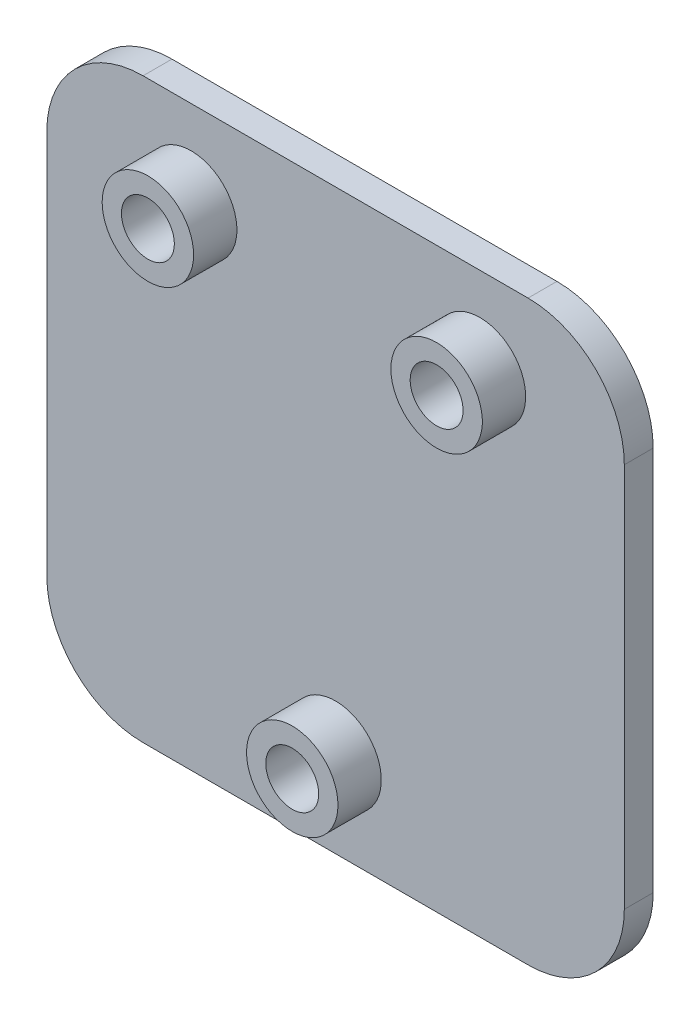
ISO-10303-21;
HEADER;
FILE_DESCRIPTION(('STEP AP214'),'2;1');
FILE_NAME('part.step','',(''),(''),'','','');
FILE_SCHEMA(('AUTOMOTIVE_DESIGN { 1 0 10303 214 1 1 1 1 }'));
ENDSEC;
DATA;
#1=APPLICATION_CONTEXT('core data for automotive mechanical design processes');
#2=APPLICATION_PROTOCOL_DEFINITION('international standard','automotive_design',2000,#1);
#3=PRODUCT_CONTEXT('',#1,'mechanical');
#4=PRODUCT('Part','Part','',(#3));
#5=PRODUCT_RELATED_PRODUCT_CATEGORY('part','',(#4));
#6=PRODUCT_DEFINITION_FORMATION('','',#4);
#7=PRODUCT_DEFINITION_CONTEXT('part definition',#1,'design');
#8=PRODUCT_DEFINITION('design','',#6,#7);
#9=PRODUCT_DEFINITION_SHAPE('','',#8);
#10=(LENGTH_UNIT() NAMED_UNIT(*) SI_UNIT(.MILLI.,.METRE.));
#11=(NAMED_UNIT(*) PLANE_ANGLE_UNIT() SI_UNIT($,.RADIAN.));
#12=(NAMED_UNIT(*) SI_UNIT($,.STERADIAN.) SOLID_ANGLE_UNIT());
#13=UNCERTAINTY_MEASURE_WITH_UNIT(LENGTH_MEASURE(1.E-05),#10,'distance_accuracy_value','');
#14=(GEOMETRIC_REPRESENTATION_CONTEXT(3) GLOBAL_UNCERTAINTY_ASSIGNED_CONTEXT((#13)) GLOBAL_UNIT_ASSIGNED_CONTEXT((#10,
#11,#12)) REPRESENTATION_CONTEXT('',''));
#15=CARTESIAN_POINT('',(0.,0.,0.));
#16=DIRECTION('',(0.,0.,1.));
#17=DIRECTION('',(1.,0.,0.));
#18=AXIS2_PLACEMENT_3D('',#15,#16,#17);
#19=CARTESIAN_POINT('',(-20.,20.,3.));
#20=DIRECTION('',(0.,0.,-1.));
#21=DIRECTION('',(-1.,0.,0.));
#22=AXIS2_PLACEMENT_3D('',#19,#20,#21);
#23=PLANE('',#22);
#24=CARTESIAN_POINT('',(0.,-21.,3.));
#25=DIRECTION('',(0.,0.,-1.));
#26=DIRECTION('',(-1.,0.,0.));
#27=AXIS2_PLACEMENT_3D('',#24,#25,#26);
#28=CIRCLE('',#27,4.74999999999999);
#29=CARTESIAN_POINT('',(-4.74999999999999,-21.,3.));
#30=VERTEX_POINT('',#29);
#31=EDGE_CURVE('E46',#30,#30,#28,.F.);
#32=ORIENTED_EDGE('',*,*,#31,.F.);
#33=EDGE_LOOP('',(#32));
#34=FACE_BOUND('',#33,.T.);
#35=CARTESIAN_POINT('',(-20.,20.,3.));
#36=DIRECTION('',(0.,0.,1.));
#37=DIRECTION('',(-1.,0.,0.));
#38=AXIS2_PLACEMENT_3D('',#35,#36,#37);
#39=CIRCLE('',#38,10.);
#40=CARTESIAN_POINT('',(-19.9999999999999,30.,3.));
#41=VERTEX_POINT('',#40);
#42=CARTESIAN_POINT('',(-30.,19.9999999999999,3.));
#43=VERTEX_POINT('',#42);
#44=EDGE_CURVE('E150',#41,#43,#39,.T.);
#45=ORIENTED_EDGE('',*,*,#44,.T.);
#46=DIRECTION('',(0.,-1.,0.));
#47=VECTOR('',#46,1.);
#48=CARTESIAN_POINT('',(-30.,-19.9999999999999,3.));
#49=LINE('',#48,#47);
#50=CARTESIAN_POINT('',(-30.,-19.9999999999999,3.));
#51=VERTEX_POINT('',#50);
#52=EDGE_CURVE('E98',#43,#51,#49,.T.);
#53=ORIENTED_EDGE('',*,*,#52,.T.);
#54=CARTESIAN_POINT('',(-20.,-20.,3.));
#55=DIRECTION('',(0.,0.,1.));
#56=DIRECTION('',(-1.,0.,0.));
#57=AXIS2_PLACEMENT_3D('',#54,#55,#56);
#58=CIRCLE('',#57,10.);
#59=CARTESIAN_POINT('',(-19.9999999999999,-30.,3.));
#60=VERTEX_POINT('',#59);
#61=EDGE_CURVE('E214',#51,#60,#58,.T.);
#62=ORIENTED_EDGE('',*,*,#61,.T.);
#63=DIRECTION('',(1.,0.,0.));
#64=VECTOR('',#63,1.);
#65=CARTESIAN_POINT('',(-19.9999999999999,-30.,3.));
#66=LINE('',#65,#64);
#67=CARTESIAN_POINT('',(19.9999999999999,-30.,3.));
#68=VERTEX_POINT('',#67);
#69=EDGE_CURVE('E220',#60,#68,#66,.T.);
#70=ORIENTED_EDGE('',*,*,#69,.T.);
#71=CARTESIAN_POINT('',(20.,-20.,3.));
#72=DIRECTION('',(0.,0.,1.));
#73=DIRECTION('',(1.,0.,0.));
#74=AXIS2_PLACEMENT_3D('',#71,#72,#73);
#75=CIRCLE('',#74,10.);
#76=CARTESIAN_POINT('',(30.,-20.,3.));
#77=VERTEX_POINT('',#76);
#78=EDGE_CURVE('E117',#68,#77,#75,.T.);
#79=ORIENTED_EDGE('',*,*,#78,.T.);
#80=DIRECTION('',(0.,1.,0.));
#81=VECTOR('',#80,1.);
#82=CARTESIAN_POINT('',(30.,-19.9999999999999,3.));
#83=LINE('',#82,#81);
#84=CARTESIAN_POINT('',(30.,19.9999999999999,3.));
#85=VERTEX_POINT('',#84);
#86=EDGE_CURVE('E111',#77,#85,#83,.T.);
#87=ORIENTED_EDGE('',*,*,#86,.T.);
#88=CARTESIAN_POINT('',(20.,20.,3.));
#89=DIRECTION('',(0.,0.,1.));
#90=DIRECTION('',(-1.,0.,0.));
#91=AXIS2_PLACEMENT_3D('',#88,#89,#90);
#92=CIRCLE('',#91,10.);
#93=CARTESIAN_POINT('',(19.9999999999999,30.,3.));
#94=VERTEX_POINT('',#93);
#95=EDGE_CURVE('E115',#85,#94,#92,.T.);
#96=ORIENTED_EDGE('',*,*,#95,.T.);
#97=DIRECTION('',(-1.,0.,0.));
#98=VECTOR('',#97,1.);
#99=CARTESIAN_POINT('',(-19.9999999999999,30.,3.));
#100=LINE('',#99,#98);
#101=EDGE_CURVE('E54',#94,#41,#100,.T.);
#102=ORIENTED_EDGE('',*,*,#101,.T.);
#103=EDGE_LOOP('',(#45,#53,#62,#70,#79,#87,#96,#102));
#104=FACE_BOUND('',#103,.T.);
#105=CARTESIAN_POINT('',(-15.,21.,3.));
#106=DIRECTION('',(0.,0.,-1.));
#107=DIRECTION('',(-1.,0.,0.));
#108=AXIS2_PLACEMENT_3D('',#105,#106,#107);
#109=CIRCLE('',#108,4.74999999999999);
#110=CARTESIAN_POINT('',(-19.75,21.,3.));
#111=VERTEX_POINT('',#110);
#112=EDGE_CURVE('E165',#111,#111,#109,.F.);
#113=ORIENTED_EDGE('',*,*,#112,.F.);
#114=EDGE_LOOP('',(#113));
#115=FACE_BOUND('',#114,.T.);
#116=CARTESIAN_POINT('',(15.,21.,3.));
#117=DIRECTION('',(0.,0.,-1.));
#118=DIRECTION('',(-1.,0.,0.));
#119=AXIS2_PLACEMENT_3D('',#116,#117,#118);
#120=CIRCLE('',#119,4.74999999999999);
#121=CARTESIAN_POINT('',(10.25,21.,3.));
#122=VERTEX_POINT('',#121);
#123=EDGE_CURVE('E11',#122,#122,#120,.F.);
#124=ORIENTED_EDGE('',*,*,#123,.F.);
#125=EDGE_LOOP('',(#124));
#126=FACE_BOUND('',#125,.T.);
#127=ADVANCED_FACE('F37',(#34,#104,#115,#126),#23,.F.);
#128=CARTESIAN_POINT('',(-20.,20.,0.));
#129=DIRECTION('',(0.,0.,-1.));
#130=DIRECTION('',(-1.,0.,0.));
#131=AXIS2_PLACEMENT_3D('',#128,#129,#130);
#132=PLANE('',#131);
#133=CARTESIAN_POINT('',(0.,-21.,0.));
#134=DIRECTION('',(0.,0.,1.));
#135=DIRECTION('',(1.,0.,0.));
#136=AXIS2_PLACEMENT_3D('',#133,#134,#135);
#137=CIRCLE('',#136,2.75);
#138=CARTESIAN_POINT('',(2.75,-21.,0.));
#139=VERTEX_POINT('',#138);
#140=EDGE_CURVE('E228',#139,#139,#137,.T.);
#141=ORIENTED_EDGE('',*,*,#140,.T.);
#142=EDGE_LOOP('',(#141));
#143=FACE_BOUND('',#142,.T.);
#144=CARTESIAN_POINT('',(-20.,20.,0.));
#145=DIRECTION('',(0.,0.,1.));
#146=DIRECTION('',(-1.,0.,0.));
#147=AXIS2_PLACEMENT_3D('',#144,#145,#146);
#148=CIRCLE('',#147,10.);
#149=CARTESIAN_POINT('',(-19.9999999999999,30.,0.));
#150=VERTEX_POINT('',#149);
#151=CARTESIAN_POINT('',(-30.,19.9999999999999,0.));
#152=VERTEX_POINT('',#151);
#153=EDGE_CURVE('E135',#150,#152,#148,.T.);
#154=ORIENTED_EDGE('',*,*,#153,.F.);
#155=DIRECTION('',(-1.,0.,0.));
#156=VECTOR('',#155,1.);
#157=CARTESIAN_POINT('',(-19.9999999999999,30.,0.));
#158=LINE('',#157,#156);
#159=CARTESIAN_POINT('',(19.9999999999999,30.,0.));
#160=VERTEX_POINT('',#159);
#161=EDGE_CURVE('E89',#160,#150,#158,.T.);
#162=ORIENTED_EDGE('',*,*,#161,.F.);
#163=CARTESIAN_POINT('',(20.,20.,0.));
#164=DIRECTION('',(0.,0.,1.));
#165=DIRECTION('',(-1.,0.,0.));
#166=AXIS2_PLACEMENT_3D('',#163,#164,#165);
#167=CIRCLE('',#166,10.);
#168=CARTESIAN_POINT('',(30.,19.9999999999999,0.));
#169=VERTEX_POINT('',#168);
#170=EDGE_CURVE('E83',#169,#160,#167,.T.);
#171=ORIENTED_EDGE('',*,*,#170,.F.);
#172=DIRECTION('',(0.,1.,0.));
#173=VECTOR('',#172,1.);
#174=CARTESIAN_POINT('',(30.,-19.9999999999999,0.));
#175=LINE('',#174,#173);
#176=CARTESIAN_POINT('',(30.,-20.,0.));
#177=VERTEX_POINT('',#176);
#178=EDGE_CURVE('E125',#177,#169,#175,.T.);
#179=ORIENTED_EDGE('',*,*,#178,.F.);
#180=CARTESIAN_POINT('',(20.,-20.,0.));
#181=DIRECTION('',(0.,0.,1.));
#182=DIRECTION('',(1.,0.,0.));
#183=AXIS2_PLACEMENT_3D('',#180,#181,#182);
#184=CIRCLE('',#183,10.);
#185=CARTESIAN_POINT('',(19.9999999999999,-30.,0.));
#186=VERTEX_POINT('',#185);
#187=EDGE_CURVE('E145',#186,#177,#184,.T.);
#188=ORIENTED_EDGE('',*,*,#187,.F.);
#189=DIRECTION('',(1.,0.,0.));
#190=VECTOR('',#189,1.);
#191=CARTESIAN_POINT('',(-19.9999999999999,-30.,0.));
#192=LINE('',#191,#190);
#193=CARTESIAN_POINT('',(-19.9999999999999,-30.,0.));
#194=VERTEX_POINT('',#193);
#195=EDGE_CURVE('E143',#194,#186,#192,.T.);
#196=ORIENTED_EDGE('',*,*,#195,.F.);
#197=CARTESIAN_POINT('',(-20.,-20.,0.));
#198=DIRECTION('',(0.,0.,1.));
#199=DIRECTION('',(-1.,0.,0.));
#200=AXIS2_PLACEMENT_3D('',#197,#198,#199);
#201=CIRCLE('',#200,10.);
#202=CARTESIAN_POINT('',(-30.,-19.9999999999999,0.));
#203=VERTEX_POINT('',#202);
#204=EDGE_CURVE('E141',#203,#194,#201,.T.);
#205=ORIENTED_EDGE('',*,*,#204,.F.);
#206=DIRECTION('',(0.,-1.,0.));
#207=VECTOR('',#206,1.);
#208=CARTESIAN_POINT('',(-30.,-19.9999999999999,0.));
#209=LINE('',#208,#207);
#210=EDGE_CURVE('E138',#152,#203,#209,.T.);
#211=ORIENTED_EDGE('',*,*,#210,.F.);
#212=EDGE_LOOP('',(#154,#162,#171,#179,#188,#196,#205,#211));
#213=FACE_BOUND('',#212,.T.);
#214=CARTESIAN_POINT('',(-15.,21.,0.));
#215=DIRECTION('',(0.,0.,1.));
#216=DIRECTION('',(1.,0.,0.));
#217=AXIS2_PLACEMENT_3D('',#214,#215,#216);
#218=CIRCLE('',#217,2.74999999999999);
#219=CARTESIAN_POINT('',(-12.25,21.,0.));
#220=VERTEX_POINT('',#219);
#221=EDGE_CURVE('E139',#220,#220,#218,.T.);
#222=ORIENTED_EDGE('',*,*,#221,.T.);
#223=EDGE_LOOP('',(#222));
#224=FACE_BOUND('',#223,.T.);
#225=CARTESIAN_POINT('',(15.,21.,0.));
#226=DIRECTION('',(0.,0.,1.));
#227=DIRECTION('',(-1.,0.,0.));
#228=AXIS2_PLACEMENT_3D('',#225,#226,#227);
#229=CIRCLE('',#228,2.74999999999999);
#230=CARTESIAN_POINT('',(12.25,21.,0.));
#231=VERTEX_POINT('',#230);
#232=EDGE_CURVE('E231',#231,#231,#229,.T.);
#233=ORIENTED_EDGE('',*,*,#232,.T.);
#234=EDGE_LOOP('',(#233));
#235=FACE_BOUND('',#234,.T.);
#236=ADVANCED_FACE('F173',(#143,#213,#224,#235),#132,.T.);
#237=CARTESIAN_POINT('',(-20.,20.,3.));
#238=DIRECTION('',(0.,0.,-1.));
#239=DIRECTION('',(-1.,0.,0.));
#240=AXIS2_PLACEMENT_3D('',#237,#238,#239);
#241=CYLINDRICAL_SURFACE('',#240,10.);
#242=ORIENTED_EDGE('',*,*,#153,.T.);
#243=DIRECTION('',(0.,0.,-1.));
#244=VECTOR('',#243,1.);
#245=CARTESIAN_POINT('',(-30.,19.9999999999999,3.));
#246=LINE('',#245,#244);
#247=EDGE_CURVE('E163',#43,#152,#246,.T.);
#248=ORIENTED_EDGE('',*,*,#247,.F.);
#249=ORIENTED_EDGE('',*,*,#44,.F.);
#250=DIRECTION('',(0.,0.,-1.));
#251=VECTOR('',#250,1.);
#252=CARTESIAN_POINT('',(-19.9999999999999,30.,3.));
#253=LINE('',#252,#251);
#254=EDGE_CURVE('E131',#41,#150,#253,.T.);
#255=ORIENTED_EDGE('',*,*,#254,.T.);
#256=EDGE_LOOP('',(#242,#248,#249,#255));
#257=FACE_BOUND('',#256,.T.);
#258=ADVANCED_FACE('F39',(#257),#241,.T.);
#259=CARTESIAN_POINT('',(-30.,-19.9999999999999,3.));
#260=DIRECTION('',(1.,0.,0.));
#261=DIRECTION('',(0.,0.,-1.));
#262=AXIS2_PLACEMENT_3D('',#259,#260,#261);
#263=PLANE('',#262);
#264=ORIENTED_EDGE('',*,*,#210,.T.);
#265=DIRECTION('',(0.,0.,-1.));
#266=VECTOR('',#265,1.);
#267=CARTESIAN_POINT('',(-30.,-19.9999999999999,3.));
#268=LINE('',#267,#266);
#269=EDGE_CURVE('E160',#51,#203,#268,.T.);
#270=ORIENTED_EDGE('',*,*,#269,.F.);
#271=ORIENTED_EDGE('',*,*,#52,.F.);
#272=ORIENTED_EDGE('',*,*,#247,.T.);
#273=EDGE_LOOP('',(#264,#270,#271,#272));
#274=FACE_BOUND('',#273,.T.);
#275=ADVANCED_FACE('F201',(#274),#263,.F.);
#276=CARTESIAN_POINT('',(-20.,-20.,3.));
#277=DIRECTION('',(0.,0.,-1.));
#278=DIRECTION('',(-1.,0.,0.));
#279=AXIS2_PLACEMENT_3D('',#276,#277,#278);
#280=CYLINDRICAL_SURFACE('',#279,10.);
#281=ORIENTED_EDGE('',*,*,#204,.T.);
#282=DIRECTION('',(0.,0.,-1.));
#283=VECTOR('',#282,1.);
#284=CARTESIAN_POINT('',(-19.9999999999999,-30.,3.));
#285=LINE('',#284,#283);
#286=EDGE_CURVE('E157',#60,#194,#285,.T.);
#287=ORIENTED_EDGE('',*,*,#286,.F.);
#288=ORIENTED_EDGE('',*,*,#61,.F.);
#289=ORIENTED_EDGE('',*,*,#269,.T.);
#290=EDGE_LOOP('',(#281,#287,#288,#289));
#291=FACE_BOUND('',#290,.T.);
#292=ADVANCED_FACE('F198',(#291),#280,.T.);
#293=CARTESIAN_POINT('',(-19.9999999999999,-30.,3.));
#294=DIRECTION('',(0.,1.,0.));
#295=DIRECTION('',(0.,0.,1.));
#296=AXIS2_PLACEMENT_3D('',#293,#294,#295);
#297=PLANE('',#296);
#298=ORIENTED_EDGE('',*,*,#195,.T.);
#299=DIRECTION('',(0.,0.,-1.));
#300=VECTOR('',#299,1.);
#301=CARTESIAN_POINT('',(19.9999999999999,-30.,3.));
#302=LINE('',#301,#300);
#303=EDGE_CURVE('E154',#68,#186,#302,.T.);
#304=ORIENTED_EDGE('',*,*,#303,.F.);
#305=ORIENTED_EDGE('',*,*,#69,.F.);
#306=ORIENTED_EDGE('',*,*,#286,.T.);
#307=EDGE_LOOP('',(#298,#304,#305,#306));
#308=FACE_BOUND('',#307,.T.);
#309=ADVANCED_FACE('F194',(#308),#297,.F.);
#310=CARTESIAN_POINT('',(20.,-20.,3.));
#311=DIRECTION('',(0.,0.,-1.));
#312=DIRECTION('',(-1.,0.,0.));
#313=AXIS2_PLACEMENT_3D('',#310,#311,#312);
#314=CYLINDRICAL_SURFACE('',#313,10.);
#315=ORIENTED_EDGE('',*,*,#187,.T.);
#316=DIRECTION('',(0.,0.,-1.));
#317=VECTOR('',#316,1.);
#318=CARTESIAN_POINT('',(30.,-20.,3.));
#319=LINE('',#318,#317);
#320=EDGE_CURVE('E126',#77,#177,#319,.T.);
#321=ORIENTED_EDGE('',*,*,#320,.F.);
#322=ORIENTED_EDGE('',*,*,#78,.F.);
#323=ORIENTED_EDGE('',*,*,#303,.T.);
#324=EDGE_LOOP('',(#315,#321,#322,#323));
#325=FACE_BOUND('',#324,.T.);
#326=ADVANCED_FACE('F191',(#325),#314,.T.);
#327=CARTESIAN_POINT('',(30.,-19.9999999999999,3.));
#328=DIRECTION('',(-1.,0.,0.));
#329=DIRECTION('',(0.,0.,1.));
#330=AXIS2_PLACEMENT_3D('',#327,#328,#329);
#331=PLANE('',#330);
#332=ORIENTED_EDGE('',*,*,#178,.T.);
#333=DIRECTION('',(0.,0.,-1.));
#334=VECTOR('',#333,1.);
#335=CARTESIAN_POINT('',(30.,19.9999999999999,3.));
#336=LINE('',#335,#334);
#337=EDGE_CURVE('E122',#85,#169,#336,.T.);
#338=ORIENTED_EDGE('',*,*,#337,.F.);
#339=ORIENTED_EDGE('',*,*,#86,.F.);
#340=ORIENTED_EDGE('',*,*,#320,.T.);
#341=EDGE_LOOP('',(#332,#338,#339,#340));
#342=FACE_BOUND('',#341,.T.);
#343=ADVANCED_FACE('F123',(#342),#331,.F.);
#344=CARTESIAN_POINT('',(20.,20.,3.));
#345=DIRECTION('',(0.,0.,-1.));
#346=DIRECTION('',(-1.,0.,0.));
#347=AXIS2_PLACEMENT_3D('',#344,#345,#346);
#348=CYLINDRICAL_SURFACE('',#347,10.);
#349=ORIENTED_EDGE('',*,*,#170,.T.);
#350=DIRECTION('',(0.,0.,-1.));
#351=VECTOR('',#350,1.);
#352=CARTESIAN_POINT('',(19.9999999999999,30.,3.));
#353=LINE('',#352,#351);
#354=EDGE_CURVE('E127',#94,#160,#353,.T.);
#355=ORIENTED_EDGE('',*,*,#354,.F.);
#356=ORIENTED_EDGE('',*,*,#95,.F.);
#357=ORIENTED_EDGE('',*,*,#337,.T.);
#358=EDGE_LOOP('',(#349,#355,#356,#357));
#359=FACE_BOUND('',#358,.T.);
#360=ADVANCED_FACE('F129',(#359),#348,.T.);
#361=CARTESIAN_POINT('',(-19.9999999999999,30.,3.));
#362=DIRECTION('',(0.,-1.,0.));
#363=DIRECTION('',(0.,0.,-1.));
#364=AXIS2_PLACEMENT_3D('',#361,#362,#363);
#365=PLANE('',#364);
#366=ORIENTED_EDGE('',*,*,#161,.T.);
#367=ORIENTED_EDGE('',*,*,#254,.F.);
#368=ORIENTED_EDGE('',*,*,#101,.F.);
#369=ORIENTED_EDGE('',*,*,#354,.T.);
#370=EDGE_LOOP('',(#366,#367,#368,#369));
#371=FACE_BOUND('',#370,.T.);
#372=ADVANCED_FACE('F184',(#371),#365,.F.);
#373=CARTESIAN_POINT('',(-15.,21.,3.));
#374=DIRECTION('',(0.,0.,-1.));
#375=DIRECTION('',(-1.,0.,0.));
#376=AXIS2_PLACEMENT_3D('',#373,#374,#375);
#377=CYLINDRICAL_SURFACE('',#376,2.74999999999999);
#378=ORIENTED_EDGE('',*,*,#221,.F.);
#379=EDGE_LOOP('',(#378));
#380=FACE_BOUND('',#379,.T.);
#381=CARTESIAN_POINT('',(-15.,21.,7.5));
#382=DIRECTION('',(0.,0.,1.));
#383=DIRECTION('',(1.,0.,0.));
#384=AXIS2_PLACEMENT_3D('',#381,#382,#383);
#385=CIRCLE('',#384,2.74999999999999);
#386=CARTESIAN_POINT('',(-12.25,21.,7.5));
#387=VERTEX_POINT('',#386);
#388=EDGE_CURVE('E237',#387,#387,#385,.T.);
#389=ORIENTED_EDGE('',*,*,#388,.T.);
#390=EDGE_LOOP('',(#389));
#391=FACE_BOUND('',#390,.T.);
#392=ADVANCED_FACE('F181',(#380,#391),#377,.F.);
#393=CARTESIAN_POINT('',(0.,-21.,3.));
#394=DIRECTION('',(0.,0.,-1.));
#395=DIRECTION('',(-1.,0.,0.));
#396=AXIS2_PLACEMENT_3D('',#393,#394,#395);
#397=CYLINDRICAL_SURFACE('',#396,2.75);
#398=ORIENTED_EDGE('',*,*,#140,.F.);
#399=EDGE_LOOP('',(#398));
#400=FACE_BOUND('',#399,.T.);
#401=CARTESIAN_POINT('',(0.,-21.,7.5));
#402=DIRECTION('',(0.,0.,1.));
#403=DIRECTION('',(1.,0.,0.));
#404=AXIS2_PLACEMENT_3D('',#401,#402,#403);
#405=CIRCLE('',#404,2.75);
#406=CARTESIAN_POINT('',(2.75,-21.,7.5));
#407=VERTEX_POINT('',#406);
#408=EDGE_CURVE('E240',#407,#407,#405,.T.);
#409=ORIENTED_EDGE('',*,*,#408,.T.);
#410=EDGE_LOOP('',(#409));
#411=FACE_BOUND('',#410,.T.);
#412=ADVANCED_FACE('F284',(#400,#411),#397,.F.);
#413=CARTESIAN_POINT('',(15.,21.,3.));
#414=DIRECTION('',(0.,0.,-1.));
#415=DIRECTION('',(-1.,0.,0.));
#416=AXIS2_PLACEMENT_3D('',#413,#414,#415);
#417=CYLINDRICAL_SURFACE('',#416,2.74999999999999);
#418=ORIENTED_EDGE('',*,*,#232,.F.);
#419=EDGE_LOOP('',(#418));
#420=FACE_BOUND('',#419,.T.);
#421=CARTESIAN_POINT('',(15.,21.,7.5));
#422=DIRECTION('',(0.,0.,1.));
#423=DIRECTION('',(-1.,0.,0.));
#424=AXIS2_PLACEMENT_3D('',#421,#422,#423);
#425=CIRCLE('',#424,2.74999999999999);
#426=CARTESIAN_POINT('',(12.25,21.,7.5));
#427=VERTEX_POINT('',#426);
#428=EDGE_CURVE('E246',#427,#427,#425,.T.);
#429=ORIENTED_EDGE('',*,*,#428,.T.);
#430=EDGE_LOOP('',(#429));
#431=FACE_BOUND('',#430,.T.);
#432=ADVANCED_FACE('F278',(#420,#431),#417,.F.);
#433=CARTESIAN_POINT('',(-15.,21.,7.5));
#434=DIRECTION('',(0.,0.,1.));
#435=DIRECTION('',(1.,0.,0.));
#436=AXIS2_PLACEMENT_3D('',#433,#434,#435);
#437=PLANE('',#436);
#438=CARTESIAN_POINT('',(-15.,21.,7.5));
#439=DIRECTION('',(0.,0.,1.));
#440=DIRECTION('',(1.,0.,0.));
#441=AXIS2_PLACEMENT_3D('',#438,#439,#440);
#442=CIRCLE('',#441,4.74999999999999);
#443=CARTESIAN_POINT('',(-10.25,21.,7.5));
#444=VERTEX_POINT('',#443);
#445=EDGE_CURVE('E234',#444,#444,#442,.T.);
#446=ORIENTED_EDGE('',*,*,#445,.T.);
#447=EDGE_LOOP('',(#446));
#448=FACE_BOUND('',#447,.T.);
#449=ORIENTED_EDGE('',*,*,#388,.F.);
#450=EDGE_LOOP('',(#449));
#451=FACE_BOUND('',#450,.T.);
#452=ADVANCED_FACE('F275',(#448,#451),#437,.T.);
#453=CARTESIAN_POINT('',(-15.,21.,7.5));
#454=DIRECTION('',(0.,0.,-1.));
#455=DIRECTION('',(-1.,0.,0.));
#456=AXIS2_PLACEMENT_3D('',#453,#454,#455);
#457=CYLINDRICAL_SURFACE('',#456,4.74999999999999);
#458=ORIENTED_EDGE('',*,*,#445,.F.);
#459=EDGE_LOOP('',(#458));
#460=FACE_BOUND('',#459,.T.);
#461=ORIENTED_EDGE('',*,*,#112,.T.);
#462=EDGE_LOOP('',(#461));
#463=FACE_BOUND('',#462,.T.);
#464=ADVANCED_FACE('F273',(#460,#463),#457,.T.);
#465=CARTESIAN_POINT('',(0.,-21.,7.5));
#466=DIRECTION('',(0.,0.,1.));
#467=DIRECTION('',(1.,0.,0.));
#468=AXIS2_PLACEMENT_3D('',#465,#466,#467);
#469=PLANE('',#468);
#470=CARTESIAN_POINT('',(0.,-21.,7.5));
#471=DIRECTION('',(0.,0.,1.));
#472=DIRECTION('',(1.,0.,0.));
#473=AXIS2_PLACEMENT_3D('',#470,#471,#472);
#474=CIRCLE('',#473,4.74999999999999);
#475=CARTESIAN_POINT('',(4.74999999999999,-21.,7.5));
#476=VERTEX_POINT('',#475);
#477=EDGE_CURVE('E243',#476,#476,#474,.T.);
#478=ORIENTED_EDGE('',*,*,#477,.T.);
#479=EDGE_LOOP('',(#478));
#480=FACE_BOUND('',#479,.T.);
#481=ORIENTED_EDGE('',*,*,#408,.F.);
#482=EDGE_LOOP('',(#481));
#483=FACE_BOUND('',#482,.T.);
#484=ADVANCED_FACE('F269',(#480,#483),#469,.T.);
#485=CARTESIAN_POINT('',(0.,-21.,7.5));
#486=DIRECTION('',(0.,0.,-1.));
#487=DIRECTION('',(-1.,0.,0.));
#488=AXIS2_PLACEMENT_3D('',#485,#486,#487);
#489=CYLINDRICAL_SURFACE('',#488,4.74999999999999);
#490=ORIENTED_EDGE('',*,*,#477,.F.);
#491=EDGE_LOOP('',(#490));
#492=FACE_BOUND('',#491,.T.);
#493=ORIENTED_EDGE('',*,*,#31,.T.);
#494=EDGE_LOOP('',(#493));
#495=FACE_BOUND('',#494,.T.);
#496=ADVANCED_FACE('F170',(#492,#495),#489,.T.);
#497=CARTESIAN_POINT('',(15.,21.,7.5));
#498=DIRECTION('',(0.,0.,-1.));
#499=DIRECTION('',(-1.,0.,0.));
#500=AXIS2_PLACEMENT_3D('',#497,#498,#499);
#501=PLANE('',#500);
#502=CARTESIAN_POINT('',(15.,21.,7.5));
#503=DIRECTION('',(0.,0.,1.));
#504=DIRECTION('',(-1.,0.,0.));
#505=AXIS2_PLACEMENT_3D('',#502,#503,#504);
#506=CIRCLE('',#505,4.74999999999999);
#507=CARTESIAN_POINT('',(10.25,21.,7.5));
#508=VERTEX_POINT('',#507);
#509=EDGE_CURVE('E249',#508,#508,#506,.T.);
#510=ORIENTED_EDGE('',*,*,#509,.T.);
#511=EDGE_LOOP('',(#510));
#512=FACE_BOUND('',#511,.T.);
#513=ORIENTED_EDGE('',*,*,#428,.F.);
#514=EDGE_LOOP('',(#513));
#515=FACE_BOUND('',#514,.T.);
#516=ADVANCED_FACE('F253',(#512,#515),#501,.F.);
#517=CARTESIAN_POINT('',(15.,21.,7.5));
#518=DIRECTION('',(0.,0.,-1.));
#519=DIRECTION('',(-1.,0.,0.));
#520=AXIS2_PLACEMENT_3D('',#517,#518,#519);
#521=CYLINDRICAL_SURFACE('',#520,4.74999999999999);
#522=ORIENTED_EDGE('',*,*,#509,.F.);
#523=EDGE_LOOP('',(#522));
#524=FACE_BOUND('',#523,.T.);
#525=ORIENTED_EDGE('',*,*,#123,.T.);
#526=EDGE_LOOP('',(#525));
#527=FACE_BOUND('',#526,.T.);
#528=ADVANCED_FACE('F256',(#524,#527),#521,.T.);
#529=CLOSED_SHELL('',(#127,#236,#258,#275,#292,#309,#326,#343,#360,#372,#392,#412,#432,#452,
#464,#484,#496,#516,#528));
#530=MANIFOLD_SOLID_BREP('B2',#529);
#531=ADVANCED_BREP_SHAPE_REPRESENTATION('',(#18,#530),#14);
#532=SHAPE_DEFINITION_REPRESENTATION(#9,#531);
ENDSEC;
END-ISO-10303-21;
